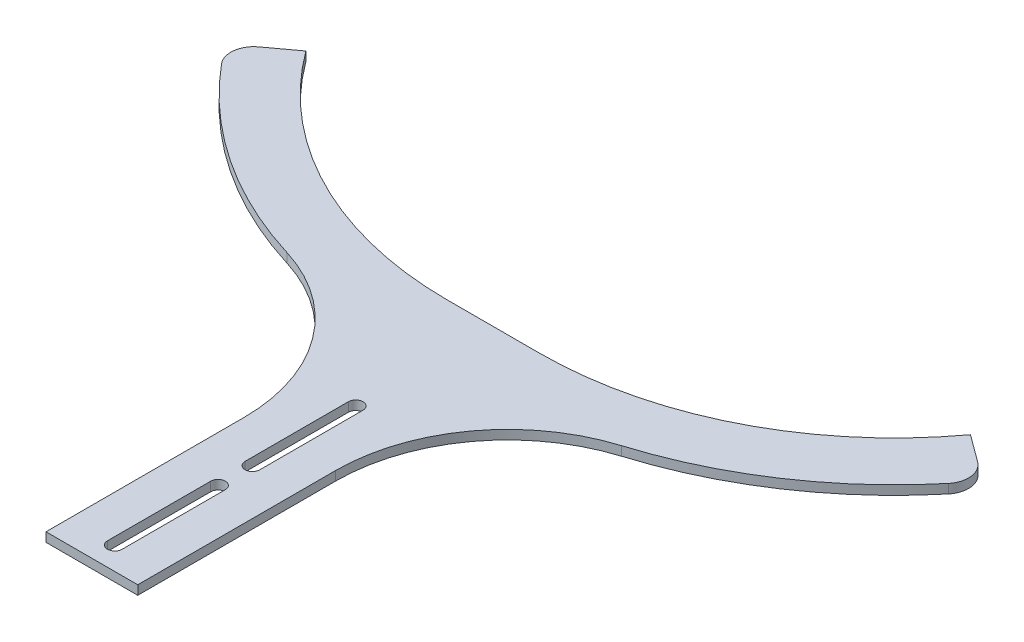
ISO-10303-21;
HEADER;
FILE_DESCRIPTION(('STEP AP214'),'2;1');
FILE_NAME('part.step','',(''),(''),'','','');
FILE_SCHEMA(('AUTOMOTIVE_DESIGN { 1 0 10303 214 1 1 1 1 }'));
ENDSEC;
DATA;
#1=APPLICATION_CONTEXT('core data for automotive mechanical design processes');
#2=APPLICATION_PROTOCOL_DEFINITION('international standard','automotive_design',2000,#1);
#3=PRODUCT_CONTEXT('',#1,'mechanical');
#4=PRODUCT('Part','Part','',(#3));
#5=PRODUCT_RELATED_PRODUCT_CATEGORY('part','',(#4));
#6=PRODUCT_DEFINITION_FORMATION('','',#4);
#7=PRODUCT_DEFINITION_CONTEXT('part definition',#1,'design');
#8=PRODUCT_DEFINITION('design','',#6,#7);
#9=PRODUCT_DEFINITION_SHAPE('','',#8);
#10=(LENGTH_UNIT() NAMED_UNIT(*) SI_UNIT(.MILLI.,.METRE.));
#11=(NAMED_UNIT(*) PLANE_ANGLE_UNIT() SI_UNIT($,.RADIAN.));
#12=(NAMED_UNIT(*) SI_UNIT($,.STERADIAN.) SOLID_ANGLE_UNIT());
#13=UNCERTAINTY_MEASURE_WITH_UNIT(LENGTH_MEASURE(1.E-05),#10,'distance_accuracy_value','');
#14=(GEOMETRIC_REPRESENTATION_CONTEXT(3) GLOBAL_UNCERTAINTY_ASSIGNED_CONTEXT((#13)) GLOBAL_UNIT_ASSIGNED_CONTEXT((#10,
#11,#12)) REPRESENTATION_CONTEXT('',''));
#15=CARTESIAN_POINT('',(0.,0.,0.));
#16=DIRECTION('',(0.,0.,1.));
#17=DIRECTION('',(1.,0.,0.));
#18=AXIS2_PLACEMENT_3D('',#15,#16,#17);
#19=CARTESIAN_POINT('',(-20.,4.,-255.));
#20=DIRECTION('',(0.,-1.,0.));
#21=DIRECTION('',(0.,0.,-1.));
#22=AXIS2_PLACEMENT_3D('',#19,#20,#21);
#23=CYLINDRICAL_SURFACE('',#22,180.);
#24=CARTESIAN_POINT('',(-20.,4.,-255.));
#25=DIRECTION('',(0.,1.,0.));
#26=DIRECTION('',(0.,0.,1.));
#27=AXIS2_PLACEMENT_3D('',#24,#25,#26);
#28=CIRCLE('',#27,180.);
#29=CARTESIAN_POINT('',(-72.9411764705882,4.,-82.9615396665324));
#30=VERTEX_POINT('',#29);
#31=CARTESIAN_POINT('',(-158.475173734746,4.,-140.001624971776));
#32=VERTEX_POINT('',#31);
#33=EDGE_CURVE('E234',#30,#32,#28,.F.);
#34=ORIENTED_EDGE('',*,*,#33,.T.);
#35=DIRECTION('',(0.,-1.,0.));
#36=VECTOR('',#35,1.);
#37=CARTESIAN_POINT('',(-158.475173734746,4.,-140.001624971776));
#38=LINE('',#37,#36);
#39=CARTESIAN_POINT('',(-158.475173734746,0.,-140.001624971776));
#40=VERTEX_POINT('',#39);
#41=EDGE_CURVE('E333',#32,#40,#38,.T.);
#42=ORIENTED_EDGE('',*,*,#41,.T.);
#43=CARTESIAN_POINT('',(-20.,0.,-255.));
#44=DIRECTION('',(0.,1.,0.));
#45=DIRECTION('',(0.,0.,1.));
#46=AXIS2_PLACEMENT_3D('',#43,#44,#45);
#47=CIRCLE('',#46,180.);
#48=CARTESIAN_POINT('',(-72.9411764705882,0.,-82.9615396665324));
#49=VERTEX_POINT('',#48);
#50=EDGE_CURVE('E227',#49,#40,#47,.F.);
#51=ORIENTED_EDGE('',*,*,#50,.F.);
#52=DIRECTION('',(0.,-1.,0.));
#53=VECTOR('',#52,1.);
#54=CARTESIAN_POINT('',(-72.9411764705882,4.,-82.9615396665324));
#55=LINE('',#54,#53);
#56=EDGE_CURVE('E318',#30,#49,#55,.T.);
#57=ORIENTED_EDGE('',*,*,#56,.F.);
#58=EDGE_LOOP('',(#34,#42,#51,#57));
#59=FACE_BOUND('',#58,.T.);
#60=ADVANCED_FACE('F36',(#59),#23,.T.);
#61=CARTESIAN_POINT('',(-95.,4.,-11.278847860921));
#62=DIRECTION('',(0.,-1.,0.));
#63=DIRECTION('',(0.,0.,-1.));
#64=AXIS2_PLACEMENT_3D('',#61,#62,#63);
#65=CYLINDRICAL_SURFACE('',#64,75.);
#66=CARTESIAN_POINT('',(-95.,0.,-11.278847860921));
#67=DIRECTION('',(0.,1.,0.));
#68=DIRECTION('',(0.,0.,1.));
#69=AXIS2_PLACEMENT_3D('',#66,#67,#68);
#70=CIRCLE('',#69,75.);
#71=CARTESIAN_POINT('',(-20.,0.,-11.278847860921));
#72=VERTEX_POINT('',#71);
#73=EDGE_CURVE('E269',#49,#72,#70,.F.);
#74=ORIENTED_EDGE('',*,*,#73,.T.);
#75=DIRECTION('',(0.,-1.,0.));
#76=VECTOR('',#75,1.);
#77=CARTESIAN_POINT('',(-20.,4.,-11.278847860921));
#78=LINE('',#77,#76);
#79=CARTESIAN_POINT('',(-20.,4.,-11.278847860921));
#80=VERTEX_POINT('',#79);
#81=EDGE_CURVE('E315',#80,#72,#78,.T.);
#82=ORIENTED_EDGE('',*,*,#81,.F.);
#83=CARTESIAN_POINT('',(-95.,4.,-11.278847860921));
#84=DIRECTION('',(0.,1.,0.));
#85=DIRECTION('',(0.,0.,1.));
#86=AXIS2_PLACEMENT_3D('',#83,#84,#85);
#87=CIRCLE('',#86,75.);
#88=EDGE_CURVE('E237',#30,#80,#87,.F.);
#89=ORIENTED_EDGE('',*,*,#88,.F.);
#90=ORIENTED_EDGE('',*,*,#56,.T.);
#91=EDGE_LOOP('',(#74,#82,#89,#90));
#92=FACE_BOUND('',#91,.T.);
#93=ADVANCED_FACE('F374',(#92),#65,.F.);
#94=CARTESIAN_POINT('',(-20.,4.,-71.7198742168906));
#95=DIRECTION('',(1.,0.,0.));
#96=DIRECTION('',(0.,0.,-1.));
#97=AXIS2_PLACEMENT_3D('',#94,#95,#96);
#98=PLANE('',#97);
#99=DIRECTION('',(0.,0.,1.));
#100=VECTOR('',#99,1.);
#101=CARTESIAN_POINT('',(-20.,0.,-71.7198742168906));
#102=LINE('',#101,#100);
#103=CARTESIAN_POINT('',(-20.,0.,74.9999999999999));
#104=VERTEX_POINT('',#103);
#105=EDGE_CURVE('E271',#72,#104,#102,.T.);
#106=ORIENTED_EDGE('',*,*,#105,.T.);
#107=DIRECTION('',(0.,-1.,0.));
#108=VECTOR('',#107,1.);
#109=CARTESIAN_POINT('',(-20.,4.,74.9999999999999));
#110=LINE('',#109,#108);
#111=CARTESIAN_POINT('',(-20.,4.,74.9999999999999));
#112=VERTEX_POINT('',#111);
#113=EDGE_CURVE('E312',#112,#104,#110,.T.);
#114=ORIENTED_EDGE('',*,*,#113,.F.);
#115=DIRECTION('',(0.,0.,1.));
#116=VECTOR('',#115,1.);
#117=CARTESIAN_POINT('',(-20.,4.,-71.7198742168906));
#118=LINE('',#117,#116);
#119=EDGE_CURVE('E240',#80,#112,#118,.T.);
#120=ORIENTED_EDGE('',*,*,#119,.F.);
#121=ORIENTED_EDGE('',*,*,#81,.T.);
#122=EDGE_LOOP('',(#106,#114,#120,#121));
#123=FACE_BOUND('',#122,.T.);
#124=ADVANCED_FACE('F380',(#123),#98,.F.);
#125=CARTESIAN_POINT('',(-337.406372594466,4.,74.9999999999999));
#126=DIRECTION('',(0.,0.,-1.));
#127=DIRECTION('',(-1.,0.,0.));
#128=AXIS2_PLACEMENT_3D('',#125,#126,#127);
#129=PLANE('',#128);
#130=DIRECTION('',(1.,0.,0.));
#131=VECTOR('',#130,1.);
#132=CARTESIAN_POINT('',(-337.406372594466,0.,74.9999999999999));
#133=LINE('',#132,#131);
#134=CARTESIAN_POINT('',(20.,0.,74.9999999999999));
#135=VERTEX_POINT('',#134);
#136=EDGE_CURVE('E273',#104,#135,#133,.T.);
#137=ORIENTED_EDGE('',*,*,#136,.T.);
#138=DIRECTION('',(0.,-1.,0.));
#139=VECTOR('',#138,1.);
#140=CARTESIAN_POINT('',(20.,4.,74.9999999999999));
#141=LINE('',#140,#139);
#142=CARTESIAN_POINT('',(20.,4.,74.9999999999999));
#143=VERTEX_POINT('',#142);
#144=EDGE_CURVE('E310',#143,#135,#141,.T.);
#145=ORIENTED_EDGE('',*,*,#144,.F.);
#146=DIRECTION('',(1.,0.,0.));
#147=VECTOR('',#146,1.);
#148=CARTESIAN_POINT('',(-337.406372594466,4.,74.9999999999999));
#149=LINE('',#148,#147);
#150=EDGE_CURVE('E242',#112,#143,#149,.T.);
#151=ORIENTED_EDGE('',*,*,#150,.F.);
#152=ORIENTED_EDGE('',*,*,#113,.T.);
#153=EDGE_LOOP('',(#137,#145,#151,#152));
#154=FACE_BOUND('',#153,.T.);
#155=ADVANCED_FACE('F439',(#154),#129,.F.);
#156=CARTESIAN_POINT('',(20.,4.,-71.7198742168906));
#157=DIRECTION('',(1.,0.,0.));
#158=DIRECTION('',(0.,0.,-1.));
#159=AXIS2_PLACEMENT_3D('',#156,#157,#158);
#160=PLANE('',#159);
#161=DIRECTION('',(0.,0.,1.));
#162=VECTOR('',#161,1.);
#163=CARTESIAN_POINT('',(20.,0.,-71.7198742168906));
#164=LINE('',#163,#162);
#165=CARTESIAN_POINT('',(20.,0.,-11.278847860921));
#166=VERTEX_POINT('',#165);
#167=EDGE_CURVE('E276',#166,#135,#164,.T.);
#168=ORIENTED_EDGE('',*,*,#167,.F.);
#169=DIRECTION('',(0.,-1.,0.));
#170=VECTOR('',#169,1.);
#171=CARTESIAN_POINT('',(20.,4.,-11.278847860921));
#172=LINE('',#171,#170);
#173=CARTESIAN_POINT('',(20.,4.,-11.278847860921));
#174=VERTEX_POINT('',#173);
#175=EDGE_CURVE('E308',#174,#166,#172,.T.);
#176=ORIENTED_EDGE('',*,*,#175,.F.);
#177=DIRECTION('',(0.,0.,1.));
#178=VECTOR('',#177,1.);
#179=CARTESIAN_POINT('',(20.,4.,-71.7198742168906));
#180=LINE('',#179,#178);
#181=EDGE_CURVE('E244',#174,#143,#180,.T.);
#182=ORIENTED_EDGE('',*,*,#181,.T.);
#183=ORIENTED_EDGE('',*,*,#144,.T.);
#184=EDGE_LOOP('',(#168,#176,#182,#183));
#185=FACE_BOUND('',#184,.T.);
#186=ADVANCED_FACE('F442',(#185),#160,.T.);
#187=CARTESIAN_POINT('',(95.,4.,-11.278847860921));
#188=DIRECTION('',(0.,-1.,0.));
#189=DIRECTION('',(0.,0.,-1.));
#190=AXIS2_PLACEMENT_3D('',#187,#188,#189);
#191=CYLINDRICAL_SURFACE('',#190,75.);
#192=CARTESIAN_POINT('',(95.,0.,-11.278847860921));
#193=DIRECTION('',(0.,1.,0.));
#194=DIRECTION('',(0.,0.,1.));
#195=AXIS2_PLACEMENT_3D('',#192,#193,#194);
#196=CIRCLE('',#195,75.);
#197=CARTESIAN_POINT('',(72.9411764705882,0.,-82.9615396665324));
#198=VERTEX_POINT('',#197);
#199=EDGE_CURVE('E279',#198,#166,#196,.T.);
#200=ORIENTED_EDGE('',*,*,#199,.F.);
#201=DIRECTION('',(0.,-1.,0.));
#202=VECTOR('',#201,1.);
#203=CARTESIAN_POINT('',(72.9411764705882,4.,-82.9615396665324));
#204=LINE('',#203,#202);
#205=CARTESIAN_POINT('',(72.9411764705882,4.,-82.9615396665324));
#206=VERTEX_POINT('',#205);
#207=EDGE_CURVE('E306',#206,#198,#204,.T.);
#208=ORIENTED_EDGE('',*,*,#207,.F.);
#209=CARTESIAN_POINT('',(95.,4.,-11.278847860921));
#210=DIRECTION('',(0.,1.,0.));
#211=DIRECTION('',(0.,0.,1.));
#212=AXIS2_PLACEMENT_3D('',#209,#210,#211);
#213=CIRCLE('',#212,75.);
#214=EDGE_CURVE('E247',#206,#174,#213,.T.);
#215=ORIENTED_EDGE('',*,*,#214,.T.);
#216=ORIENTED_EDGE('',*,*,#175,.T.);
#217=EDGE_LOOP('',(#200,#208,#215,#216));
#218=FACE_BOUND('',#217,.T.);
#219=ADVANCED_FACE('F445',(#218),#191,.F.);
#220=CARTESIAN_POINT('',(20.,4.,-255.));
#221=DIRECTION('',(0.,-1.,0.));
#222=DIRECTION('',(0.,0.,-1.));
#223=AXIS2_PLACEMENT_3D('',#220,#221,#222);
#224=CYLINDRICAL_SURFACE('',#223,180.);
#225=CARTESIAN_POINT('',(20.,0.,-255.));
#226=DIRECTION('',(0.,1.,0.));
#227=DIRECTION('',(0.,0.,1.));
#228=AXIS2_PLACEMENT_3D('',#225,#226,#227);
#229=CIRCLE('',#228,180.);
#230=CARTESIAN_POINT('',(158.475173734746,0.,-140.001624971776));
#231=VERTEX_POINT('',#230);
#232=EDGE_CURVE('E282',#198,#231,#229,.T.);
#233=ORIENTED_EDGE('',*,*,#232,.T.);
#234=DIRECTION('',(0.,-1.,0.));
#235=VECTOR('',#234,1.);
#236=CARTESIAN_POINT('',(158.475173734746,4.,-140.001624971776));
#237=LINE('',#236,#235);
#238=CARTESIAN_POINT('',(158.475173734746,4.,-140.001624971776));
#239=VERTEX_POINT('',#238);
#240=EDGE_CURVE('E327',#231,#239,#237,.F.);
#241=ORIENTED_EDGE('',*,*,#240,.T.);
#242=CARTESIAN_POINT('',(20.,4.,-255.));
#243=DIRECTION('',(0.,1.,0.));
#244=DIRECTION('',(0.,0.,1.));
#245=AXIS2_PLACEMENT_3D('',#242,#243,#244);
#246=CIRCLE('',#245,180.);
#247=EDGE_CURVE('E250',#206,#239,#246,.T.);
#248=ORIENTED_EDGE('',*,*,#247,.F.);
#249=ORIENTED_EDGE('',*,*,#207,.T.);
#250=EDGE_LOOP('',(#233,#241,#248,#249));
#251=FACE_BOUND('',#250,.T.);
#252=ADVANCED_FACE('F448',(#251),#224,.T.);
#253=CARTESIAN_POINT('',(-124.44698856498,4.,-361.24688169166));
#254=DIRECTION('',(-0.592520250213932,0.,0.805555555555555));
#255=DIRECTION('',(0.805555555555555,0.,0.592520250213932));
#256=AXIS2_PLACEMENT_3D('',#253,#254,#255);
#257=PLANE('',#256);
#258=DIRECTION('',(-0.805555555555555,0.,-0.592520250213932));
#259=VECTOR('',#258,1.);
#260=CARTESIAN_POINT('',(-124.44698856498,4.,-361.24688169166));
#261=LINE('',#260,#259);
#262=CARTESIAN_POINT('',(156.707311029399,4.,-154.445979140011));
#263=VERTEX_POINT('',#262);
#264=CARTESIAN_POINT('',(144.861111111111,4.,-163.15936121684));
#265=VERTEX_POINT('',#264);
#266=EDGE_CURVE('E253',#263,#265,#261,.T.);
#267=ORIENTED_EDGE('',*,*,#266,.F.);
#268=DIRECTION('',(0.,-1.,0.));
#269=VECTOR('',#268,1.);
#270=CARTESIAN_POINT('',(156.707311029399,4.,-154.445979140011));
#271=LINE('',#270,#269);
#272=CARTESIAN_POINT('',(156.707311029399,0.,-154.445979140011));
#273=VERTEX_POINT('',#272);
#274=EDGE_CURVE('E320',#263,#273,#271,.T.);
#275=ORIENTED_EDGE('',*,*,#274,.T.);
#276=DIRECTION('',(-0.805555555555555,0.,-0.592520250213932));
#277=VECTOR('',#276,1.);
#278=CARTESIAN_POINT('',(-124.44698856498,0.,-361.24688169166));
#279=LINE('',#278,#277);
#280=CARTESIAN_POINT('',(144.861111111111,0.,-163.15936121684));
#281=VERTEX_POINT('',#280);
#282=EDGE_CURVE('E285',#273,#281,#279,.T.);
#283=ORIENTED_EDGE('',*,*,#282,.T.);
#284=DIRECTION('',(0.,-1.,0.));
#285=VECTOR('',#284,1.);
#286=CARTESIAN_POINT('',(144.861111111111,4.,-163.15936121684));
#287=LINE('',#286,#285);
#288=EDGE_CURVE('E303',#265,#281,#287,.T.);
#289=ORIENTED_EDGE('',*,*,#288,.F.);
#290=EDGE_LOOP('',(#267,#275,#283,#289));
#291=FACE_BOUND('',#290,.T.);
#292=ADVANCED_FACE('F404',(#291),#257,.F.);
#293=CARTESIAN_POINT('',(20.,4.,-255.));
#294=DIRECTION('',(0.,-1.,0.));
#295=DIRECTION('',(0.,0.,-1.));
#296=AXIS2_PLACEMENT_3D('',#293,#294,#295);
#297=CYLINDRICAL_SURFACE('',#296,155.);
#298=CARTESIAN_POINT('',(20.,0.,-255.));
#299=DIRECTION('',(0.,1.,0.));
#300=DIRECTION('',(0.,0.,1.));
#301=AXIS2_PLACEMENT_3D('',#298,#299,#300);
#302=CIRCLE('',#301,155.);
#303=CARTESIAN_POINT('',(20.,0.,-99.9999999999995));
#304=VERTEX_POINT('',#303);
#305=EDGE_CURVE('E287',#304,#281,#302,.T.);
#306=ORIENTED_EDGE('',*,*,#305,.F.);
#307=DIRECTION('',(0.,-1.,0.));
#308=VECTOR('',#307,1.);
#309=CARTESIAN_POINT('',(20.,4.,-99.9999999999995));
#310=LINE('',#309,#308);
#311=CARTESIAN_POINT('',(20.,4.,-99.9999999999995));
#312=VERTEX_POINT('',#311);
#313=EDGE_CURVE('E301',#312,#304,#310,.T.);
#314=ORIENTED_EDGE('',*,*,#313,.F.);
#315=CARTESIAN_POINT('',(20.,4.,-255.));
#316=DIRECTION('',(0.,1.,0.));
#317=DIRECTION('',(0.,0.,1.));
#318=AXIS2_PLACEMENT_3D('',#315,#316,#317);
#319=CIRCLE('',#318,155.);
#320=EDGE_CURVE('E255',#312,#265,#319,.T.);
#321=ORIENTED_EDGE('',*,*,#320,.T.);
#322=ORIENTED_EDGE('',*,*,#288,.T.);
#323=EDGE_LOOP('',(#306,#314,#321,#322));
#324=FACE_BOUND('',#323,.T.);
#325=ADVANCED_FACE('F408',(#324),#297,.F.);
#326=CARTESIAN_POINT('',(-337.406372594466,4.,-99.9999999999993));
#327=DIRECTION('',(0.,0.,-1.));
#328=DIRECTION('',(-1.,0.,0.));
#329=AXIS2_PLACEMENT_3D('',#326,#327,#328);
#330=PLANE('',#329);
#331=DIRECTION('',(1.,0.,0.));
#332=VECTOR('',#331,1.);
#333=CARTESIAN_POINT('',(-337.406372594466,0.,-99.9999999999993));
#334=LINE('',#333,#332);
#335=CARTESIAN_POINT('',(-20.0000000000001,0.,-99.9999999999994));
#336=VERTEX_POINT('',#335);
#337=EDGE_CURVE('E290',#336,#304,#334,.T.);
#338=ORIENTED_EDGE('',*,*,#337,.F.);
#339=DIRECTION('',(0.,-1.,0.));
#340=VECTOR('',#339,1.);
#341=CARTESIAN_POINT('',(-20.0000000000001,4.,-99.9999999999994));
#342=LINE('',#341,#340);
#343=CARTESIAN_POINT('',(-20.0000000000001,4.,-99.9999999999994));
#344=VERTEX_POINT('',#343);
#345=EDGE_CURVE('E299',#344,#336,#342,.T.);
#346=ORIENTED_EDGE('',*,*,#345,.F.);
#347=DIRECTION('',(1.,0.,0.));
#348=VECTOR('',#347,1.);
#349=CARTESIAN_POINT('',(-337.406372594466,4.,-99.9999999999993));
#350=LINE('',#349,#348);
#351=EDGE_CURVE('E258',#344,#312,#350,.T.);
#352=ORIENTED_EDGE('',*,*,#351,.T.);
#353=ORIENTED_EDGE('',*,*,#313,.T.);
#354=EDGE_LOOP('',(#338,#346,#352,#353));
#355=FACE_BOUND('',#354,.T.);
#356=ADVANCED_FACE('F412',(#355),#330,.T.);
#357=CARTESIAN_POINT('',(-20.,4.,-255.));
#358=DIRECTION('',(0.,-1.,0.));
#359=DIRECTION('',(0.,0.,-1.));
#360=AXIS2_PLACEMENT_3D('',#357,#358,#359);
#361=CYLINDRICAL_SURFACE('',#360,155.);
#362=CARTESIAN_POINT('',(-20.,0.,-255.));
#363=DIRECTION('',(0.,1.,0.));
#364=DIRECTION('',(0.,0.,1.));
#365=AXIS2_PLACEMENT_3D('',#362,#363,#364);
#366=CIRCLE('',#365,155.);
#367=CARTESIAN_POINT('',(-144.861111111111,0.,-163.15936121684));
#368=VERTEX_POINT('',#367);
#369=EDGE_CURVE('E293',#336,#368,#366,.F.);
#370=ORIENTED_EDGE('',*,*,#369,.T.);
#371=DIRECTION('',(0.,-1.,0.));
#372=VECTOR('',#371,1.);
#373=CARTESIAN_POINT('',(-144.861111111111,4.,-163.15936121684));
#374=LINE('',#373,#372);
#375=CARTESIAN_POINT('',(-144.861111111111,4.,-163.15936121684));
#376=VERTEX_POINT('',#375);
#377=EDGE_CURVE('E266',#376,#368,#374,.T.);
#378=ORIENTED_EDGE('',*,*,#377,.F.);
#379=CARTESIAN_POINT('',(-20.,4.,-255.));
#380=DIRECTION('',(0.,1.,0.));
#381=DIRECTION('',(0.,0.,1.));
#382=AXIS2_PLACEMENT_3D('',#379,#380,#381);
#383=CIRCLE('',#382,155.);
#384=EDGE_CURVE('E261',#344,#376,#383,.F.);
#385=ORIENTED_EDGE('',*,*,#384,.F.);
#386=ORIENTED_EDGE('',*,*,#345,.T.);
#387=EDGE_LOOP('',(#370,#378,#385,#386));
#388=FACE_BOUND('',#387,.T.);
#389=ADVANCED_FACE('F417',(#388),#361,.F.);
#390=CARTESIAN_POINT('',(-313.45233142259,4.,-39.1533738533272));
#391=DIRECTION('',(-0.592520250213933,0.,-0.805555555555555));
#392=DIRECTION('',(-0.805555555555555,0.,0.592520250213933));
#393=AXIS2_PLACEMENT_3D('',#390,#391,#392);
#394=PLANE('',#393);
#395=DIRECTION('',(0.805555555555555,0.,-0.592520250213933));
#396=VECTOR('',#395,1.);
#397=CARTESIAN_POINT('',(-313.45233142259,0.,-39.1533738533272));
#398=LINE('',#397,#396);
#399=CARTESIAN_POINT('',(-156.707311029399,0.,-154.445979140011));
#400=VERTEX_POINT('',#399);
#401=EDGE_CURVE('E238',#400,#368,#398,.T.);
#402=ORIENTED_EDGE('',*,*,#401,.F.);
#403=DIRECTION('',(0.,-1.,0.));
#404=VECTOR('',#403,1.);
#405=CARTESIAN_POINT('',(-156.707311029399,4.,-154.445979140011));
#406=LINE('',#405,#404);
#407=CARTESIAN_POINT('',(-156.707311029399,4.,-154.445979140011));
#408=VERTEX_POINT('',#407);
#409=EDGE_CURVE('E336',#400,#408,#406,.F.);
#410=ORIENTED_EDGE('',*,*,#409,.T.);
#411=DIRECTION('',(0.805555555555555,0.,-0.592520250213933));
#412=VECTOR('',#411,1.);
#413=CARTESIAN_POINT('',(-313.45233142259,4.,-39.1533738533272));
#414=LINE('',#413,#412);
#415=EDGE_CURVE('E264',#408,#376,#414,.T.);
#416=ORIENTED_EDGE('',*,*,#415,.T.);
#417=ORIENTED_EDGE('',*,*,#377,.T.);
#418=EDGE_LOOP('',(#402,#410,#416,#417));
#419=FACE_BOUND('',#418,.T.);
#420=ADVANCED_FACE('F449',(#419),#394,.T.);
#421=CARTESIAN_POINT('',(-337.406372594466,4.,-71.7198742168906));
#422=DIRECTION('',(0.,1.,0.));
#423=DIRECTION('',(0.,0.,1.));
#424=AXIS2_PLACEMENT_3D('',#421,#422,#423);
#425=PLANE('',#424);
#426=CARTESIAN_POINT('',(0.,4.,20.0000000000003));
#427=DIRECTION('',(0.,1.,0.));
#428=DIRECTION('',(0.,0.,1.));
#429=AXIS2_PLACEMENT_3D('',#426,#427,#428);
#430=CIRCLE('',#429,3.2);
#431=CARTESIAN_POINT('',(3.2,4.,20.0000000000003));
#432=VERTEX_POINT('',#431);
#433=CARTESIAN_POINT('',(-3.19999999999999,4.,20.0000000000003));
#434=VERTEX_POINT('',#433);
#435=EDGE_CURVE('E51',#432,#434,#430,.T.);
#436=ORIENTED_EDGE('',*,*,#435,.F.);
#437=DIRECTION('',(0.,0.,-1.));
#438=VECTOR('',#437,1.);
#439=CARTESIAN_POINT('',(3.2,4.,20.0000000000003));
#440=LINE('',#439,#438);
#441=CARTESIAN_POINT('',(3.20000000000001,4.,65.0000000000003));
#442=VERTEX_POINT('',#441);
#443=EDGE_CURVE('E204',#442,#432,#440,.T.);
#444=ORIENTED_EDGE('',*,*,#443,.F.);
#445=CARTESIAN_POINT('',(0.,4.,65.0000000000003));
#446=DIRECTION('',(0.,1.,0.));
#447=DIRECTION('',(0.,0.,1.));
#448=AXIS2_PLACEMENT_3D('',#445,#446,#447);
#449=CIRCLE('',#448,3.2);
#450=CARTESIAN_POINT('',(-3.2,4.,65.0000000000003));
#451=VERTEX_POINT('',#450);
#452=EDGE_CURVE('E188',#451,#442,#449,.T.);
#453=ORIENTED_EDGE('',*,*,#452,.F.);
#454=DIRECTION('',(0.,0.,1.));
#455=VECTOR('',#454,1.);
#456=CARTESIAN_POINT('',(-3.2,4.,20.0000000000003));
#457=LINE('',#456,#455);
#458=EDGE_CURVE('E197',#434,#451,#457,.T.);
#459=ORIENTED_EDGE('',*,*,#458,.F.);
#460=EDGE_LOOP('',(#436,#444,#453,#459));
#461=FACE_BOUND('',#460,.T.);
#462=CARTESIAN_POINT('',(0.,4.,-39.9999999999997));
#463=DIRECTION('',(0.,1.,0.));
#464=DIRECTION('',(0.,0.,1.));
#465=AXIS2_PLACEMENT_3D('',#462,#463,#464);
#466=CIRCLE('',#465,3.2);
#467=CARTESIAN_POINT('',(3.20000000000002,4.,-39.9999999999997));
#468=VERTEX_POINT('',#467);
#469=CARTESIAN_POINT('',(-3.19999999999998,4.,-39.9999999999997));
#470=VERTEX_POINT('',#469);
#471=EDGE_CURVE('E211',#468,#470,#466,.T.);
#472=ORIENTED_EDGE('',*,*,#471,.F.);
#473=DIRECTION('',(0.,0.,-1.));
#474=VECTOR('',#473,1.);
#475=CARTESIAN_POINT('',(3.20000000000002,4.,-39.9999999999997));
#476=LINE('',#475,#474);
#477=CARTESIAN_POINT('',(3.2,4.,5.00000000000032));
#478=VERTEX_POINT('',#477);
#479=EDGE_CURVE('E221',#478,#468,#476,.T.);
#480=ORIENTED_EDGE('',*,*,#479,.F.);
#481=CARTESIAN_POINT('',(0.,4.,5.00000000000032));
#482=DIRECTION('',(0.,1.,0.));
#483=DIRECTION('',(0.,0.,1.));
#484=AXIS2_PLACEMENT_3D('',#481,#482,#483);
#485=CIRCLE('',#484,3.2);
#486=CARTESIAN_POINT('',(-3.19999999999999,4.,5.00000000000032));
#487=VERTEX_POINT('',#486);
#488=EDGE_CURVE('E218',#487,#478,#485,.T.);
#489=ORIENTED_EDGE('',*,*,#488,.F.);
#490=DIRECTION('',(0.,0.,1.));
#491=VECTOR('',#490,1.);
#492=CARTESIAN_POINT('',(-3.19999999999999,4.,-39.9999999999997));
#493=LINE('',#492,#491);
#494=EDGE_CURVE('E215',#470,#487,#493,.T.);
#495=ORIENTED_EDGE('',*,*,#494,.F.);
#496=EDGE_LOOP('',(#472,#480,#489,#495));
#497=FACE_BOUND('',#496,.T.);
#498=ORIENTED_EDGE('',*,*,#247,.T.);
#499=CARTESIAN_POINT('',(150.78210852726,4.,-146.390423584455));
#500=DIRECTION('',(0.,1.,0.));
#501=DIRECTION('',(0.,0.,1.));
#502=AXIS2_PLACEMENT_3D('',#499,#500,#501);
#503=CIRCLE('',#502,10.);
#504=EDGE_CURVE('E331',#239,#263,#503,.T.);
#505=ORIENTED_EDGE('',*,*,#504,.T.);
#506=ORIENTED_EDGE('',*,*,#266,.T.);
#507=ORIENTED_EDGE('',*,*,#320,.F.);
#508=ORIENTED_EDGE('',*,*,#351,.F.);
#509=ORIENTED_EDGE('',*,*,#384,.T.);
#510=ORIENTED_EDGE('',*,*,#415,.F.);
#511=CARTESIAN_POINT('',(-150.78210852726,4.,-146.390423584455));
#512=DIRECTION('',(0.,1.,0.));
#513=DIRECTION('',(0.,0.,1.));
#514=AXIS2_PLACEMENT_3D('',#511,#512,#513);
#515=CIRCLE('',#514,10.);
#516=EDGE_CURVE('E329',#408,#32,#515,.T.);
#517=ORIENTED_EDGE('',*,*,#516,.T.);
#518=ORIENTED_EDGE('',*,*,#33,.F.);
#519=ORIENTED_EDGE('',*,*,#88,.T.);
#520=ORIENTED_EDGE('',*,*,#119,.T.);
#521=ORIENTED_EDGE('',*,*,#150,.T.);
#522=ORIENTED_EDGE('',*,*,#181,.F.);
#523=ORIENTED_EDGE('',*,*,#214,.F.);
#524=EDGE_LOOP('',(#498,#505,#506,#507,#508,#509,#510,#517,#518,#519,#520,#521,#522,#523));
#525=FACE_BOUND('',#524,.T.);
#526=ADVANCED_FACE('F201',(#461,#497,#525),#425,.T.);
#527=CARTESIAN_POINT('',(-337.406372594466,0.,-71.7198742168906));
#528=DIRECTION('',(0.,1.,0.));
#529=DIRECTION('',(0.,0.,1.));
#530=AXIS2_PLACEMENT_3D('',#527,#528,#529);
#531=PLANE('',#530);
#532=DIRECTION('',(0.,0.,-1.));
#533=VECTOR('',#532,1.);
#534=CARTESIAN_POINT('',(3.19999999999998,0.,-71.7198742168907));
#535=LINE('',#534,#533);
#536=CARTESIAN_POINT('',(3.20000000000001,0.,65.0000000000003));
#537=VERTEX_POINT('',#536);
#538=CARTESIAN_POINT('',(3.2,0.,20.0000000000003));
#539=VERTEX_POINT('',#538);
#540=EDGE_CURVE('E44',#537,#539,#535,.T.);
#541=ORIENTED_EDGE('',*,*,#540,.T.);
#542=CARTESIAN_POINT('',(0.,0.,20.0000000000003));
#543=DIRECTION('',(0.,1.,0.));
#544=DIRECTION('',(0.,0.,1.));
#545=AXIS2_PLACEMENT_3D('',#542,#543,#544);
#546=CIRCLE('',#545,3.2);
#547=CARTESIAN_POINT('',(-3.2,0.,20.0000000000003));
#548=VERTEX_POINT('',#547);
#549=EDGE_CURVE('E11',#539,#548,#546,.T.);
#550=ORIENTED_EDGE('',*,*,#549,.T.);
#551=DIRECTION('',(0.,0.,1.));
#552=VECTOR('',#551,1.);
#553=CARTESIAN_POINT('',(-3.19999999999998,0.,-71.7198742168906));
#554=LINE('',#553,#552);
#555=CARTESIAN_POINT('',(-3.19999999999999,0.,65.0000000000003));
#556=VERTEX_POINT('',#555);
#557=EDGE_CURVE('E350',#548,#556,#554,.T.);
#558=ORIENTED_EDGE('',*,*,#557,.T.);
#559=CARTESIAN_POINT('',(0.,0.,65.0000000000003));
#560=DIRECTION('',(0.,1.,0.));
#561=DIRECTION('',(0.,0.,1.));
#562=AXIS2_PLACEMENT_3D('',#559,#560,#561);
#563=CIRCLE('',#562,3.2);
#564=EDGE_CURVE('E191',#556,#537,#563,.T.);
#565=ORIENTED_EDGE('',*,*,#564,.T.);
#566=EDGE_LOOP('',(#541,#550,#558,#565));
#567=FACE_BOUND('',#566,.T.);
#568=DIRECTION('',(0.,0.,-1.));
#569=VECTOR('',#568,1.);
#570=CARTESIAN_POINT('',(3.20000000000004,0.,-71.7198742168905));
#571=LINE('',#570,#569);
#572=CARTESIAN_POINT('',(3.2,0.,5.00000000000032));
#573=VERTEX_POINT('',#572);
#574=CARTESIAN_POINT('',(3.20000000000002,0.,-39.9999999999997));
#575=VERTEX_POINT('',#574);
#576=EDGE_CURVE('E344',#573,#575,#571,.T.);
#577=ORIENTED_EDGE('',*,*,#576,.T.);
#578=CARTESIAN_POINT('',(0.,0.,-39.9999999999997));
#579=DIRECTION('',(0.,1.,0.));
#580=DIRECTION('',(0.,0.,1.));
#581=AXIS2_PLACEMENT_3D('',#578,#579,#580);
#582=CIRCLE('',#581,3.2);
#583=CARTESIAN_POINT('',(-3.19999999999999,0.,-39.9999999999997));
#584=VERTEX_POINT('',#583);
#585=EDGE_CURVE('E347',#575,#584,#582,.T.);
#586=ORIENTED_EDGE('',*,*,#585,.T.);
#587=DIRECTION('',(0.,0.,1.));
#588=VECTOR('',#587,1.);
#589=CARTESIAN_POINT('',(-3.19999999999998,0.,-71.7198742168906));
#590=LINE('',#589,#588);
#591=CARTESIAN_POINT('',(-3.19999999999999,0.,5.00000000000032));
#592=VERTEX_POINT('',#591);
#593=EDGE_CURVE('E338',#584,#592,#590,.T.);
#594=ORIENTED_EDGE('',*,*,#593,.T.);
#595=CARTESIAN_POINT('',(0.,0.,5.00000000000032));
#596=DIRECTION('',(0.,1.,0.));
#597=DIRECTION('',(0.,0.,1.));
#598=AXIS2_PLACEMENT_3D('',#595,#596,#597);
#599=CIRCLE('',#598,3.2);
#600=EDGE_CURVE('E341',#592,#573,#599,.T.);
#601=ORIENTED_EDGE('',*,*,#600,.T.);
#602=EDGE_LOOP('',(#577,#586,#594,#601));
#603=FACE_BOUND('',#602,.T.);
#604=ORIENTED_EDGE('',*,*,#282,.F.);
#605=CARTESIAN_POINT('',(150.78210852726,0.,-146.390423584455));
#606=DIRECTION('',(0.,1.,0.));
#607=DIRECTION('',(0.,0.,1.));
#608=AXIS2_PLACEMENT_3D('',#605,#606,#607);
#609=CIRCLE('',#608,10.);
#610=EDGE_CURVE('E325',#273,#231,#609,.F.);
#611=ORIENTED_EDGE('',*,*,#610,.T.);
#612=ORIENTED_EDGE('',*,*,#232,.F.);
#613=ORIENTED_EDGE('',*,*,#199,.T.);
#614=ORIENTED_EDGE('',*,*,#167,.T.);
#615=ORIENTED_EDGE('',*,*,#136,.F.);
#616=ORIENTED_EDGE('',*,*,#105,.F.);
#617=ORIENTED_EDGE('',*,*,#73,.F.);
#618=ORIENTED_EDGE('',*,*,#50,.T.);
#619=CARTESIAN_POINT('',(-150.78210852726,0.,-146.390423584455));
#620=DIRECTION('',(0.,1.,0.));
#621=DIRECTION('',(0.,0.,1.));
#622=AXIS2_PLACEMENT_3D('',#619,#620,#621);
#623=CIRCLE('',#622,10.);
#624=EDGE_CURVE('E323',#40,#400,#623,.F.);
#625=ORIENTED_EDGE('',*,*,#624,.T.);
#626=ORIENTED_EDGE('',*,*,#401,.T.);
#627=ORIENTED_EDGE('',*,*,#369,.F.);
#628=ORIENTED_EDGE('',*,*,#337,.T.);
#629=ORIENTED_EDGE('',*,*,#305,.T.);
#630=EDGE_LOOP('',(#604,#611,#612,#613,#614,#615,#616,#617,#618,#625,#626,#627,#628,#629));
#631=FACE_BOUND('',#630,.T.);
#632=ADVANCED_FACE('F354',(#567,#603,#631),#531,.F.);
#633=CARTESIAN_POINT('',(150.78210852726,4.,-146.390423584455));
#634=DIRECTION('',(0.,-1.,0.));
#635=DIRECTION('',(0.,0.,-1.));
#636=AXIS2_PLACEMENT_3D('',#633,#634,#635);
#637=CYLINDRICAL_SURFACE('',#636,10.);
#638=ORIENTED_EDGE('',*,*,#504,.F.);
#639=ORIENTED_EDGE('',*,*,#240,.F.);
#640=ORIENTED_EDGE('',*,*,#610,.F.);
#641=ORIENTED_EDGE('',*,*,#274,.F.);
#642=EDGE_LOOP('',(#638,#639,#640,#641));
#643=FACE_BOUND('',#642,.T.);
#644=ADVANCED_FACE('F384',(#643),#637,.T.);
#645=CARTESIAN_POINT('',(-150.78210852726,4.,-146.390423584455));
#646=DIRECTION('',(0.,-1.,0.));
#647=DIRECTION('',(0.,0.,-1.));
#648=AXIS2_PLACEMENT_3D('',#645,#646,#647);
#649=CYLINDRICAL_SURFACE('',#648,10.);
#650=ORIENTED_EDGE('',*,*,#516,.F.);
#651=ORIENTED_EDGE('',*,*,#409,.F.);
#652=ORIENTED_EDGE('',*,*,#624,.F.);
#653=ORIENTED_EDGE('',*,*,#41,.F.);
#654=EDGE_LOOP('',(#650,#651,#652,#653));
#655=FACE_BOUND('',#654,.T.);
#656=ADVANCED_FACE('F38',(#655),#649,.T.);
#657=CARTESIAN_POINT('',(0.,-6.,-39.9999999999997));
#658=DIRECTION('',(0.,1.,0.));
#659=DIRECTION('',(0.,0.,1.));
#660=AXIS2_PLACEMENT_3D('',#657,#658,#659);
#661=CYLINDRICAL_SURFACE('',#660,3.2);
#662=DIRECTION('',(0.,1.,0.));
#663=VECTOR('',#662,1.);
#664=CARTESIAN_POINT('',(3.20000000000002,-6.,-39.9999999999997));
#665=LINE('',#664,#663);
#666=EDGE_CURVE('E225',#575,#468,#665,.T.);
#667=ORIENTED_EDGE('',*,*,#666,.T.);
#668=ORIENTED_EDGE('',*,*,#471,.T.);
#669=DIRECTION('',(0.,1.,0.));
#670=VECTOR('',#669,1.);
#671=CARTESIAN_POINT('',(-3.19999999999999,-6.,-39.9999999999997));
#672=LINE('',#671,#670);
#673=EDGE_CURVE('E224',#584,#470,#672,.T.);
#674=ORIENTED_EDGE('',*,*,#673,.F.);
#675=ORIENTED_EDGE('',*,*,#585,.F.);
#676=EDGE_LOOP('',(#667,#668,#674,#675));
#677=FACE_BOUND('',#676,.T.);
#678=ADVANCED_FACE('F391',(#677),#661,.F.);
#679=CARTESIAN_POINT('',(3.20000000000002,-6.,-39.9999999999997));
#680=DIRECTION('',(1.,0.,0.));
#681=DIRECTION('',(0.,0.,-1.));
#682=AXIS2_PLACEMENT_3D('',#679,#680,#681);
#683=PLANE('',#682);
#684=DIRECTION('',(0.,1.,0.));
#685=VECTOR('',#684,1.);
#686=CARTESIAN_POINT('',(3.2,-6.,5.00000000000032));
#687=LINE('',#686,#685);
#688=EDGE_CURVE('E228',#573,#478,#687,.T.);
#689=ORIENTED_EDGE('',*,*,#688,.T.);
#690=ORIENTED_EDGE('',*,*,#479,.T.);
#691=ORIENTED_EDGE('',*,*,#666,.F.);
#692=ORIENTED_EDGE('',*,*,#576,.F.);
#693=EDGE_LOOP('',(#689,#690,#691,#692));
#694=FACE_BOUND('',#693,.T.);
#695=ADVANCED_FACE('F585',(#694),#683,.F.);
#696=CARTESIAN_POINT('',(0.,-6.,5.00000000000032));
#697=DIRECTION('',(0.,1.,0.));
#698=DIRECTION('',(0.,0.,1.));
#699=AXIS2_PLACEMENT_3D('',#696,#697,#698);
#700=CYLINDRICAL_SURFACE('',#699,3.2);
#701=DIRECTION('',(0.,1.,0.));
#702=VECTOR('',#701,1.);
#703=CARTESIAN_POINT('',(-3.19999999999999,-6.,5.00000000000032));
#704=LINE('',#703,#702);
#705=EDGE_CURVE('E230',#592,#487,#704,.T.);
#706=ORIENTED_EDGE('',*,*,#705,.T.);
#707=ORIENTED_EDGE('',*,*,#488,.T.);
#708=ORIENTED_EDGE('',*,*,#688,.F.);
#709=ORIENTED_EDGE('',*,*,#600,.F.);
#710=EDGE_LOOP('',(#706,#707,#708,#709));
#711=FACE_BOUND('',#710,.T.);
#712=ADVANCED_FACE('F368',(#711),#700,.F.);
#713=CARTESIAN_POINT('',(-3.19999999999999,-6.,-39.9999999999997));
#714=DIRECTION('',(-1.,0.,0.));
#715=DIRECTION('',(0.,0.,1.));
#716=AXIS2_PLACEMENT_3D('',#713,#714,#715);
#717=PLANE('',#716);
#718=ORIENTED_EDGE('',*,*,#673,.T.);
#719=ORIENTED_EDGE('',*,*,#494,.T.);
#720=ORIENTED_EDGE('',*,*,#705,.F.);
#721=ORIENTED_EDGE('',*,*,#593,.F.);
#722=EDGE_LOOP('',(#718,#719,#720,#721));
#723=FACE_BOUND('',#722,.T.);
#724=ADVANCED_FACE('F361',(#723),#717,.F.);
#725=CARTESIAN_POINT('',(0.,-6.,20.0000000000003));
#726=DIRECTION('',(0.,1.,0.));
#727=DIRECTION('',(0.,0.,1.));
#728=AXIS2_PLACEMENT_3D('',#725,#726,#727);
#729=CYLINDRICAL_SURFACE('',#728,3.2);
#730=DIRECTION('',(0.,1.,0.));
#731=VECTOR('',#730,1.);
#732=CARTESIAN_POINT('',(3.2,-6.,20.0000000000003));
#733=LINE('',#732,#731);
#734=EDGE_CURVE('E209',#539,#432,#733,.T.);
#735=ORIENTED_EDGE('',*,*,#734,.T.);
#736=ORIENTED_EDGE('',*,*,#435,.T.);
#737=DIRECTION('',(0.,1.,0.));
#738=VECTOR('',#737,1.);
#739=CARTESIAN_POINT('',(-3.2,-6.,20.0000000000003));
#740=LINE('',#739,#738);
#741=EDGE_CURVE('E194',#548,#434,#740,.T.);
#742=ORIENTED_EDGE('',*,*,#741,.F.);
#743=ORIENTED_EDGE('',*,*,#549,.F.);
#744=EDGE_LOOP('',(#735,#736,#742,#743));
#745=FACE_BOUND('',#744,.T.);
#746=ADVANCED_FACE('F359',(#745),#729,.F.);
#747=CARTESIAN_POINT('',(3.2,-6.,20.0000000000003));
#748=DIRECTION('',(1.,0.,0.));
#749=DIRECTION('',(0.,0.,-1.));
#750=AXIS2_PLACEMENT_3D('',#747,#748,#749);
#751=PLANE('',#750);
#752=DIRECTION('',(0.,1.,0.));
#753=VECTOR('',#752,1.);
#754=CARTESIAN_POINT('',(3.20000000000001,-6.,65.0000000000003));
#755=LINE('',#754,#753);
#756=EDGE_CURVE('E193',#537,#442,#755,.T.);
#757=ORIENTED_EDGE('',*,*,#756,.T.);
#758=ORIENTED_EDGE('',*,*,#443,.T.);
#759=ORIENTED_EDGE('',*,*,#734,.F.);
#760=ORIENTED_EDGE('',*,*,#540,.F.);
#761=EDGE_LOOP('',(#757,#758,#759,#760));
#762=FACE_BOUND('',#761,.T.);
#763=ADVANCED_FACE('F358',(#762),#751,.F.);
#764=CARTESIAN_POINT('',(0.,-6.,65.0000000000003));
#765=DIRECTION('',(0.,1.,0.));
#766=DIRECTION('',(0.,0.,1.));
#767=AXIS2_PLACEMENT_3D('',#764,#765,#766);
#768=CYLINDRICAL_SURFACE('',#767,3.2);
#769=DIRECTION('',(0.,1.,0.));
#770=VECTOR('',#769,1.);
#771=CARTESIAN_POINT('',(-3.2,-6.,65.0000000000003));
#772=LINE('',#771,#770);
#773=EDGE_CURVE('E59',#556,#451,#772,.T.);
#774=ORIENTED_EDGE('',*,*,#773,.T.);
#775=ORIENTED_EDGE('',*,*,#452,.T.);
#776=ORIENTED_EDGE('',*,*,#756,.F.);
#777=ORIENTED_EDGE('',*,*,#564,.F.);
#778=EDGE_LOOP('',(#774,#775,#776,#777));
#779=FACE_BOUND('',#778,.T.);
#780=ADVANCED_FACE('F185',(#779),#768,.F.);
#781=CARTESIAN_POINT('',(-3.2,-6.,20.0000000000003));
#782=DIRECTION('',(-1.,0.,0.));
#783=DIRECTION('',(0.,0.,1.));
#784=AXIS2_PLACEMENT_3D('',#781,#782,#783);
#785=PLANE('',#784);
#786=ORIENTED_EDGE('',*,*,#741,.T.);
#787=ORIENTED_EDGE('',*,*,#458,.T.);
#788=ORIENTED_EDGE('',*,*,#773,.F.);
#789=ORIENTED_EDGE('',*,*,#557,.F.);
#790=EDGE_LOOP('',(#786,#787,#788,#789));
#791=FACE_BOUND('',#790,.T.);
#792=ADVANCED_FACE('F198',(#791),#785,.F.);
#793=CLOSED_SHELL('',(#60,#93,#124,#155,#186,#219,#252,#292,#325,#356,#389,#420,#526,#632,#644,
#656,#678,#695,#712,#724,#746,#763,#780,#792));
#794=MANIFOLD_SOLID_BREP('B2',#793);
#795=ADVANCED_BREP_SHAPE_REPRESENTATION('',(#18,#794),#14);
#796=SHAPE_DEFINITION_REPRESENTATION(#9,#795);
ENDSEC;
END-ISO-10303-21;
